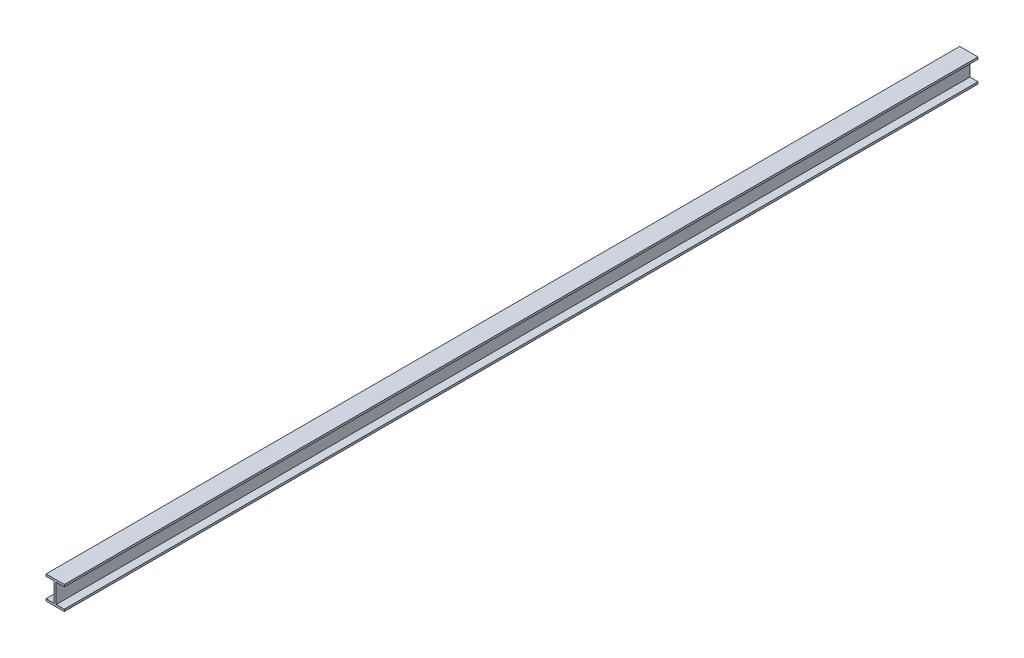
ISO-10303-21;
HEADER;
FILE_DESCRIPTION(('STEP AP214'),'2;1');
FILE_NAME('part.step','',(''),(''),'','','');
FILE_SCHEMA(('AUTOMOTIVE_DESIGN { 1 0 10303 214 1 1 1 1 }'));
ENDSEC;
DATA;
#1=APPLICATION_CONTEXT('core data for automotive mechanical design processes');
#2=APPLICATION_PROTOCOL_DEFINITION('international standard','automotive_design',2000,#1);
#3=PRODUCT_CONTEXT('',#1,'mechanical');
#4=PRODUCT('Part','Part','',(#3));
#5=PRODUCT_RELATED_PRODUCT_CATEGORY('part','',(#4));
#6=PRODUCT_DEFINITION_FORMATION('','',#4);
#7=PRODUCT_DEFINITION_CONTEXT('part definition',#1,'design');
#8=PRODUCT_DEFINITION('design','',#6,#7);
#9=PRODUCT_DEFINITION_SHAPE('','',#8);
#10=(LENGTH_UNIT() NAMED_UNIT(*) SI_UNIT(.MILLI.,.METRE.));
#11=(NAMED_UNIT(*) PLANE_ANGLE_UNIT() SI_UNIT($,.RADIAN.));
#12=(NAMED_UNIT(*) SI_UNIT($,.STERADIAN.) SOLID_ANGLE_UNIT());
#13=UNCERTAINTY_MEASURE_WITH_UNIT(LENGTH_MEASURE(1.E-05),#10,'distance_accuracy_value','');
#14=(GEOMETRIC_REPRESENTATION_CONTEXT(3) GLOBAL_UNCERTAINTY_ASSIGNED_CONTEXT((#13)) GLOBAL_UNIT_ASSIGNED_CONTEXT((#10,
#11,#12)) REPRESENTATION_CONTEXT('',''));
#15=CARTESIAN_POINT('',(0.,0.,0.));
#16=DIRECTION('',(0.,0.,1.));
#17=DIRECTION('',(1.,0.,0.));
#18=AXIS2_PLACEMENT_3D('',#15,#16,#17);
#19=CARTESIAN_POINT('',(0.,-328.,14000.));
#20=DIRECTION('',(0.,1.,0.));
#21=DIRECTION('',(0.,0.,1.));
#22=AXIS2_PLACEMENT_3D('',#19,#20,#21);
#23=PLANE('',#22);
#24=DIRECTION('',(1.,0.,0.));
#25=VECTOR('',#24,1.);
#26=CARTESIAN_POINT('',(0.,-328.,0.));
#27=LINE('',#26,#25);
#28=CARTESIAN_POINT('',(156.,-328.,0.));
#29=VERTEX_POINT('',#28);
#30=CARTESIAN_POINT('',(280.,-328.,0.));
#31=VERTEX_POINT('',#30);
#32=EDGE_CURVE('E164',#29,#31,#27,.T.);
#33=ORIENTED_EDGE('',*,*,#32,.F.);
#34=DIRECTION('',(0.,0.,-1.));
#35=VECTOR('',#34,1.);
#36=CARTESIAN_POINT('',(156.,-328.,14000.));
#37=LINE('',#36,#35);
#38=CARTESIAN_POINT('',(156.,-328.,14000.));
#39=VERTEX_POINT('',#38);
#40=EDGE_CURVE('E11',#39,#29,#37,.T.);
#41=ORIENTED_EDGE('',*,*,#40,.F.);
#42=DIRECTION('',(1.,0.,0.));
#43=VECTOR('',#42,1.);
#44=CARTESIAN_POINT('',(0.,-328.,14000.));
#45=LINE('',#44,#43);
#46=CARTESIAN_POINT('',(280.,-328.,14000.));
#47=VERTEX_POINT('',#46);
#48=EDGE_CURVE('E205',#39,#47,#45,.T.);
#49=ORIENTED_EDGE('',*,*,#48,.T.);
#50=DIRECTION('',(0.,0.,-1.));
#51=VECTOR('',#50,1.);
#52=CARTESIAN_POINT('',(280.,-328.,14000.));
#53=LINE('',#52,#51);
#54=EDGE_CURVE('E104',#47,#31,#53,.T.);
#55=ORIENTED_EDGE('',*,*,#54,.T.);
#56=EDGE_LOOP('',(#33,#41,#49,#55));
#57=FACE_BOUND('',#56,.T.);
#58=ADVANCED_FACE('F41',(#57),#23,.T.);
#59=CARTESIAN_POINT('',(156.,0.,14000.));
#60=DIRECTION('',(1.,0.,0.));
#61=DIRECTION('',(0.,1.,0.));
#62=AXIS2_PLACEMENT_3D('',#59,#60,#61);
#63=PLANE('',#62);
#64=DIRECTION('',(0.,-1.,0.));
#65=VECTOR('',#64,1.);
#66=CARTESIAN_POINT('',(156.,0.,0.));
#67=LINE('',#66,#65);
#68=CARTESIAN_POINT('',(156.,-32.,0.));
#69=VERTEX_POINT('',#68);
#70=EDGE_CURVE('E168',#69,#29,#67,.T.);
#71=ORIENTED_EDGE('',*,*,#70,.F.);
#72=DIRECTION('',(0.,0.,-1.));
#73=VECTOR('',#72,1.);
#74=CARTESIAN_POINT('',(156.,-32.,14000.));
#75=LINE('',#74,#73);
#76=CARTESIAN_POINT('',(156.,-32.,14000.));
#77=VERTEX_POINT('',#76);
#78=EDGE_CURVE('E50',#77,#69,#75,.T.);
#79=ORIENTED_EDGE('',*,*,#78,.F.);
#80=DIRECTION('',(0.,-1.,0.));
#81=VECTOR('',#80,1.);
#82=CARTESIAN_POINT('',(156.,0.,14000.));
#83=LINE('',#82,#81);
#84=EDGE_CURVE('E246',#77,#39,#83,.T.);
#85=ORIENTED_EDGE('',*,*,#84,.T.);
#86=ORIENTED_EDGE('',*,*,#40,.T.);
#87=EDGE_LOOP('',(#71,#79,#85,#86));
#88=FACE_BOUND('',#87,.T.);
#89=ADVANCED_FACE('F245',(#88),#63,.T.);
#90=CARTESIAN_POINT('',(0.,-32.,14000.));
#91=DIRECTION('',(0.,1.,0.));
#92=DIRECTION('',(-1.,0.,0.));
#93=AXIS2_PLACEMENT_3D('',#90,#91,#92);
#94=PLANE('',#93);
#95=DIRECTION('',(1.,0.,0.));
#96=VECTOR('',#95,1.);
#97=CARTESIAN_POINT('',(0.,-32.,0.));
#98=LINE('',#97,#96);
#99=CARTESIAN_POINT('',(280.,-32.,0.));
#100=VERTEX_POINT('',#99);
#101=EDGE_CURVE('E172',#69,#100,#98,.T.);
#102=ORIENTED_EDGE('',*,*,#101,.T.);
#103=DIRECTION('',(0.,0.,-1.));
#104=VECTOR('',#103,1.);
#105=CARTESIAN_POINT('',(280.,-32.,14000.));
#106=LINE('',#105,#104);
#107=CARTESIAN_POINT('',(280.,-32.,14000.));
#108=VERTEX_POINT('',#107);
#109=EDGE_CURVE('E229',#108,#100,#106,.T.);
#110=ORIENTED_EDGE('',*,*,#109,.F.);
#111=DIRECTION('',(1.,0.,0.));
#112=VECTOR('',#111,1.);
#113=CARTESIAN_POINT('',(0.,-32.,14000.));
#114=LINE('',#113,#112);
#115=EDGE_CURVE('E237',#77,#108,#114,.T.);
#116=ORIENTED_EDGE('',*,*,#115,.F.);
#117=ORIENTED_EDGE('',*,*,#78,.T.);
#118=EDGE_LOOP('',(#102,#110,#116,#117));
#119=FACE_BOUND('',#118,.T.);
#120=ADVANCED_FACE('F235',(#119),#94,.F.);
#121=CARTESIAN_POINT('',(280.,0.,14000.));
#122=DIRECTION('',(1.,0.,0.));
#123=DIRECTION('',(0.,0.,-1.));
#124=AXIS2_PLACEMENT_3D('',#121,#122,#123);
#125=PLANE('',#124);
#126=DIRECTION('',(0.,-1.,0.));
#127=VECTOR('',#126,1.);
#128=CARTESIAN_POINT('',(280.,0.,0.));
#129=LINE('',#128,#127);
#130=CARTESIAN_POINT('',(280.,0.,0.));
#131=VERTEX_POINT('',#130);
#132=EDGE_CURVE('E176',#131,#100,#129,.T.);
#133=ORIENTED_EDGE('',*,*,#132,.F.);
#134=DIRECTION('',(0.,0.,-1.));
#135=VECTOR('',#134,1.);
#136=CARTESIAN_POINT('',(280.,0.,14000.));
#137=LINE('',#136,#135);
#138=CARTESIAN_POINT('',(280.,0.,14000.));
#139=VERTEX_POINT('',#138);
#140=EDGE_CURVE('E226',#139,#131,#137,.T.);
#141=ORIENTED_EDGE('',*,*,#140,.F.);
#142=DIRECTION('',(0.,-1.,0.));
#143=VECTOR('',#142,1.);
#144=CARTESIAN_POINT('',(280.,0.,14000.));
#145=LINE('',#144,#143);
#146=EDGE_CURVE('E257',#139,#108,#145,.T.);
#147=ORIENTED_EDGE('',*,*,#146,.T.);
#148=ORIENTED_EDGE('',*,*,#109,.T.);
#149=EDGE_LOOP('',(#133,#141,#147,#148));
#150=FACE_BOUND('',#149,.T.);
#151=ADVANCED_FACE('F295',(#150),#125,.T.);
#152=CARTESIAN_POINT('',(0.,0.,14000.));
#153=DIRECTION('',(0.,1.,0.));
#154=DIRECTION('',(0.,0.,1.));
#155=AXIS2_PLACEMENT_3D('',#152,#153,#154);
#156=PLANE('',#155);
#157=DIRECTION('',(1.,0.,0.));
#158=VECTOR('',#157,1.);
#159=CARTESIAN_POINT('',(0.,0.,0.));
#160=LINE('',#159,#158);
#161=CARTESIAN_POINT('',(0.,0.,0.));
#162=VERTEX_POINT('',#161);
#163=EDGE_CURVE('E180',#162,#131,#160,.T.);
#164=ORIENTED_EDGE('',*,*,#163,.F.);
#165=DIRECTION('',(0.,0.,-1.));
#166=VECTOR('',#165,1.);
#167=CARTESIAN_POINT('',(0.,0.,14000.));
#168=LINE('',#167,#166);
#169=CARTESIAN_POINT('',(0.,0.,14000.));
#170=VERTEX_POINT('',#169);
#171=EDGE_CURVE('E223',#170,#162,#168,.T.);
#172=ORIENTED_EDGE('',*,*,#171,.F.);
#173=DIRECTION('',(1.,0.,0.));
#174=VECTOR('',#173,1.);
#175=CARTESIAN_POINT('',(0.,0.,14000.));
#176=LINE('',#175,#174);
#177=EDGE_CURVE('E261',#170,#139,#176,.T.);
#178=ORIENTED_EDGE('',*,*,#177,.T.);
#179=ORIENTED_EDGE('',*,*,#140,.T.);
#180=EDGE_LOOP('',(#164,#172,#178,#179));
#181=FACE_BOUND('',#180,.T.);
#182=ADVANCED_FACE('F292',(#181),#156,.T.);
#183=CARTESIAN_POINT('',(0.,0.,14000.));
#184=DIRECTION('',(1.,0.,0.));
#185=DIRECTION('',(0.,1.,0.));
#186=AXIS2_PLACEMENT_3D('',#183,#184,#185);
#187=PLANE('',#186);
#188=DIRECTION('',(0.,-1.,0.));
#189=VECTOR('',#188,1.);
#190=CARTESIAN_POINT('',(0.,0.,0.));
#191=LINE('',#190,#189);
#192=CARTESIAN_POINT('',(0.,-32.,0.));
#193=VERTEX_POINT('',#192);
#194=EDGE_CURVE('E184',#162,#193,#191,.T.);
#195=ORIENTED_EDGE('',*,*,#194,.T.);
#196=DIRECTION('',(0.,0.,-1.));
#197=VECTOR('',#196,1.);
#198=CARTESIAN_POINT('',(0.,-32.,14000.));
#199=LINE('',#198,#197);
#200=CARTESIAN_POINT('',(0.,-32.,14000.));
#201=VERTEX_POINT('',#200);
#202=EDGE_CURVE('E219',#201,#193,#199,.T.);
#203=ORIENTED_EDGE('',*,*,#202,.F.);
#204=DIRECTION('',(0.,-1.,0.));
#205=VECTOR('',#204,1.);
#206=CARTESIAN_POINT('',(0.,0.,14000.));
#207=LINE('',#206,#205);
#208=EDGE_CURVE('E265',#170,#201,#207,.T.);
#209=ORIENTED_EDGE('',*,*,#208,.F.);
#210=ORIENTED_EDGE('',*,*,#171,.T.);
#211=EDGE_LOOP('',(#195,#203,#209,#210));
#212=FACE_BOUND('',#211,.T.);
#213=ADVANCED_FACE('F289',(#212),#187,.F.);
#214=CARTESIAN_POINT('',(0.,-32.,14000.));
#215=DIRECTION('',(0.,1.,0.));
#216=DIRECTION('',(-1.,0.,0.));
#217=AXIS2_PLACEMENT_3D('',#214,#215,#216);
#218=PLANE('',#217);
#219=DIRECTION('',(1.,0.,0.));
#220=VECTOR('',#219,1.);
#221=CARTESIAN_POINT('',(0.,-32.,0.));
#222=LINE('',#221,#220);
#223=CARTESIAN_POINT('',(124.,-32.,0.));
#224=VERTEX_POINT('',#223);
#225=EDGE_CURVE('E187',#193,#224,#222,.T.);
#226=ORIENTED_EDGE('',*,*,#225,.T.);
#227=DIRECTION('',(0.,0.,-1.));
#228=VECTOR('',#227,1.);
#229=CARTESIAN_POINT('',(124.,-32.,14000.));
#230=LINE('',#229,#228);
#231=CARTESIAN_POINT('',(124.,-32.,14000.));
#232=VERTEX_POINT('',#231);
#233=EDGE_CURVE('E215',#232,#224,#230,.T.);
#234=ORIENTED_EDGE('',*,*,#233,.F.);
#235=DIRECTION('',(1.,0.,0.));
#236=VECTOR('',#235,1.);
#237=CARTESIAN_POINT('',(0.,-32.,14000.));
#238=LINE('',#237,#236);
#239=EDGE_CURVE('E268',#201,#232,#238,.T.);
#240=ORIENTED_EDGE('',*,*,#239,.F.);
#241=ORIENTED_EDGE('',*,*,#202,.T.);
#242=EDGE_LOOP('',(#226,#234,#240,#241));
#243=FACE_BOUND('',#242,.T.);
#244=ADVANCED_FACE('F285',(#243),#218,.F.);
#245=CARTESIAN_POINT('',(124.,0.,14000.));
#246=DIRECTION('',(1.,0.,0.));
#247=DIRECTION('',(0.,1.,0.));
#248=AXIS2_PLACEMENT_3D('',#245,#246,#247);
#249=PLANE('',#248);
#250=DIRECTION('',(0.,-1.,0.));
#251=VECTOR('',#250,1.);
#252=CARTESIAN_POINT('',(124.,0.,0.));
#253=LINE('',#252,#251);
#254=CARTESIAN_POINT('',(124.,-328.,0.));
#255=VERTEX_POINT('',#254);
#256=EDGE_CURVE('E190',#224,#255,#253,.T.);
#257=ORIENTED_EDGE('',*,*,#256,.T.);
#258=DIRECTION('',(0.,0.,-1.));
#259=VECTOR('',#258,1.);
#260=CARTESIAN_POINT('',(124.,-328.,14000.));
#261=LINE('',#260,#259);
#262=CARTESIAN_POINT('',(124.,-328.,14000.));
#263=VERTEX_POINT('',#262);
#264=EDGE_CURVE('E212',#263,#255,#261,.T.);
#265=ORIENTED_EDGE('',*,*,#264,.F.);
#266=DIRECTION('',(0.,-1.,0.));
#267=VECTOR('',#266,1.);
#268=CARTESIAN_POINT('',(124.,0.,14000.));
#269=LINE('',#268,#267);
#270=EDGE_CURVE('E158',#232,#263,#269,.T.);
#271=ORIENTED_EDGE('',*,*,#270,.F.);
#272=ORIENTED_EDGE('',*,*,#233,.T.);
#273=EDGE_LOOP('',(#257,#265,#271,#272));
#274=FACE_BOUND('',#273,.T.);
#275=ADVANCED_FACE('F276',(#274),#249,.F.);
#276=CARTESIAN_POINT('',(0.,-328.,14000.));
#277=DIRECTION('',(0.,1.,0.));
#278=DIRECTION('',(0.,0.,1.));
#279=AXIS2_PLACEMENT_3D('',#276,#277,#278);
#280=PLANE('',#279);
#281=DIRECTION('',(1.,0.,0.));
#282=VECTOR('',#281,1.);
#283=CARTESIAN_POINT('',(0.,-328.,0.));
#284=LINE('',#283,#282);
#285=CARTESIAN_POINT('',(0.,-328.,0.));
#286=VERTEX_POINT('',#285);
#287=EDGE_CURVE('E194',#286,#255,#284,.T.);
#288=ORIENTED_EDGE('',*,*,#287,.F.);
#289=DIRECTION('',(0.,0.,-1.));
#290=VECTOR('',#289,1.);
#291=CARTESIAN_POINT('',(0.,-328.,14000.));
#292=LINE('',#291,#290);
#293=CARTESIAN_POINT('',(0.,-328.,14000.));
#294=VERTEX_POINT('',#293);
#295=EDGE_CURVE('E144',#294,#286,#292,.T.);
#296=ORIENTED_EDGE('',*,*,#295,.F.);
#297=DIRECTION('',(1.,0.,0.));
#298=VECTOR('',#297,1.);
#299=CARTESIAN_POINT('',(0.,-328.,14000.));
#300=LINE('',#299,#298);
#301=EDGE_CURVE('E154',#294,#263,#300,.T.);
#302=ORIENTED_EDGE('',*,*,#301,.T.);
#303=ORIENTED_EDGE('',*,*,#264,.T.);
#304=EDGE_LOOP('',(#288,#296,#302,#303));
#305=FACE_BOUND('',#304,.T.);
#306=ADVANCED_FACE('F280',(#305),#280,.T.);
#307=CARTESIAN_POINT('',(0.,0.,14000.));
#308=DIRECTION('',(-1.,0.,0.));
#309=DIRECTION('',(0.,0.,1.));
#310=AXIS2_PLACEMENT_3D('',#307,#308,#309);
#311=PLANE('',#310);
#312=DIRECTION('',(0.,1.,0.));
#313=VECTOR('',#312,1.);
#314=CARTESIAN_POINT('',(0.,0.,0.));
#315=LINE('',#314,#313);
#316=CARTESIAN_POINT('',(0.,-360.,0.));
#317=VERTEX_POINT('',#316);
#318=EDGE_CURVE('E142',#317,#286,#315,.T.);
#319=ORIENTED_EDGE('',*,*,#318,.F.);
#320=DIRECTION('',(0.,0.,-1.));
#321=VECTOR('',#320,1.);
#322=CARTESIAN_POINT('',(0.,-360.,14000.));
#323=LINE('',#322,#321);
#324=CARTESIAN_POINT('',(0.,-360.,14000.));
#325=VERTEX_POINT('',#324);
#326=EDGE_CURVE('E136',#325,#317,#323,.T.);
#327=ORIENTED_EDGE('',*,*,#326,.F.);
#328=DIRECTION('',(0.,1.,0.));
#329=VECTOR('',#328,1.);
#330=CARTESIAN_POINT('',(0.,0.,14000.));
#331=LINE('',#330,#329);
#332=EDGE_CURVE('E140',#325,#294,#331,.T.);
#333=ORIENTED_EDGE('',*,*,#332,.T.);
#334=ORIENTED_EDGE('',*,*,#295,.T.);
#335=EDGE_LOOP('',(#319,#327,#333,#334));
#336=FACE_BOUND('',#335,.T.);
#337=ADVANCED_FACE('F138',(#336),#311,.T.);
#338=CARTESIAN_POINT('',(0.,-360.,14000.));
#339=DIRECTION('',(0.,1.,0.));
#340=DIRECTION('',(0.,0.,1.));
#341=AXIS2_PLACEMENT_3D('',#338,#339,#340);
#342=PLANE('',#341);
#343=DIRECTION('',(1.,0.,0.));
#344=VECTOR('',#343,1.);
#345=CARTESIAN_POINT('',(0.,-360.,0.));
#346=LINE('',#345,#344);
#347=CARTESIAN_POINT('',(280.,-360.,0.));
#348=VERTEX_POINT('',#347);
#349=EDGE_CURVE('E97',#317,#348,#346,.T.);
#350=ORIENTED_EDGE('',*,*,#349,.T.);
#351=DIRECTION('',(0.,0.,-1.));
#352=VECTOR('',#351,1.);
#353=CARTESIAN_POINT('',(280.,-360.,14000.));
#354=LINE('',#353,#352);
#355=CARTESIAN_POINT('',(280.,-360.,14000.));
#356=VERTEX_POINT('',#355);
#357=EDGE_CURVE('E145',#356,#348,#354,.T.);
#358=ORIENTED_EDGE('',*,*,#357,.F.);
#359=DIRECTION('',(1.,0.,0.));
#360=VECTOR('',#359,1.);
#361=CARTESIAN_POINT('',(0.,-360.,14000.));
#362=LINE('',#361,#360);
#363=EDGE_CURVE('E147',#325,#356,#362,.T.);
#364=ORIENTED_EDGE('',*,*,#363,.F.);
#365=ORIENTED_EDGE('',*,*,#326,.T.);
#366=EDGE_LOOP('',(#350,#358,#364,#365));
#367=FACE_BOUND('',#366,.T.);
#368=ADVANCED_FACE('F148',(#367),#342,.F.);
#369=CARTESIAN_POINT('',(280.,0.,14000.));
#370=DIRECTION('',(-1.,0.,0.));
#371=DIRECTION('',(0.,0.,1.));
#372=AXIS2_PLACEMENT_3D('',#369,#370,#371);
#373=PLANE('',#372);
#374=DIRECTION('',(0.,1.,0.));
#375=VECTOR('',#374,1.);
#376=CARTESIAN_POINT('',(280.,0.,0.));
#377=LINE('',#376,#375);
#378=EDGE_CURVE('E202',#348,#31,#377,.T.);
#379=ORIENTED_EDGE('',*,*,#378,.T.);
#380=ORIENTED_EDGE('',*,*,#54,.F.);
#381=DIRECTION('',(0.,1.,0.));
#382=VECTOR('',#381,1.);
#383=CARTESIAN_POINT('',(280.,0.,14000.));
#384=LINE('',#383,#382);
#385=EDGE_CURVE('E58',#356,#47,#384,.T.);
#386=ORIENTED_EDGE('',*,*,#385,.F.);
#387=ORIENTED_EDGE('',*,*,#357,.T.);
#388=EDGE_LOOP('',(#379,#380,#386,#387));
#389=FACE_BOUND('',#388,.T.);
#390=ADVANCED_FACE('F249',(#389),#373,.F.);
#391=CARTESIAN_POINT('',(0.,0.,14000.));
#392=DIRECTION('',(0.,0.,1.));
#393=DIRECTION('',(1.,0.,0.));
#394=AXIS2_PLACEMENT_3D('',#391,#392,#393);
#395=PLANE('',#394);
#396=ORIENTED_EDGE('',*,*,#48,.F.);
#397=ORIENTED_EDGE('',*,*,#84,.F.);
#398=ORIENTED_EDGE('',*,*,#115,.T.);
#399=ORIENTED_EDGE('',*,*,#146,.F.);
#400=ORIENTED_EDGE('',*,*,#177,.F.);
#401=ORIENTED_EDGE('',*,*,#208,.T.);
#402=ORIENTED_EDGE('',*,*,#239,.T.);
#403=ORIENTED_EDGE('',*,*,#270,.T.);
#404=ORIENTED_EDGE('',*,*,#301,.F.);
#405=ORIENTED_EDGE('',*,*,#332,.F.);
#406=ORIENTED_EDGE('',*,*,#363,.T.);
#407=ORIENTED_EDGE('',*,*,#385,.T.);
#408=EDGE_LOOP('',(#396,#397,#398,#399,#400,#401,#402,#403,#404,#405,#406,#407));
#409=FACE_BOUND('',#408,.T.);
#410=ADVANCED_FACE('F152',(#409),#395,.T.);
#411=CARTESIAN_POINT('',(0.,0.,0.));
#412=DIRECTION('',(0.,0.,1.));
#413=DIRECTION('',(1.,0.,0.));
#414=AXIS2_PLACEMENT_3D('',#411,#412,#413);
#415=PLANE('',#414);
#416=ORIENTED_EDGE('',*,*,#32,.T.);
#417=ORIENTED_EDGE('',*,*,#378,.F.);
#418=ORIENTED_EDGE('',*,*,#349,.F.);
#419=ORIENTED_EDGE('',*,*,#318,.T.);
#420=ORIENTED_EDGE('',*,*,#287,.T.);
#421=ORIENTED_EDGE('',*,*,#256,.F.);
#422=ORIENTED_EDGE('',*,*,#225,.F.);
#423=ORIENTED_EDGE('',*,*,#194,.F.);
#424=ORIENTED_EDGE('',*,*,#163,.T.);
#425=ORIENTED_EDGE('',*,*,#132,.T.);
#426=ORIENTED_EDGE('',*,*,#101,.F.);
#427=ORIENTED_EDGE('',*,*,#70,.T.);
#428=EDGE_LOOP('',(#416,#417,#418,#419,#420,#421,#422,#423,#424,#425,#426,#427));
#429=FACE_BOUND('',#428,.T.);
#430=ADVANCED_FACE('F243',(#429),#415,.F.);
#431=CLOSED_SHELL('',(#58,#89,#120,#151,#182,#213,#244,#275,#306,#337,#368,#390,#410,#430));
#432=MANIFOLD_SOLID_BREP('B2',#431);
#433=ADVANCED_BREP_SHAPE_REPRESENTATION('',(#18,#432),#14);
#434=SHAPE_DEFINITION_REPRESENTATION(#9,#433);
ENDSEC;
END-ISO-10303-21;
